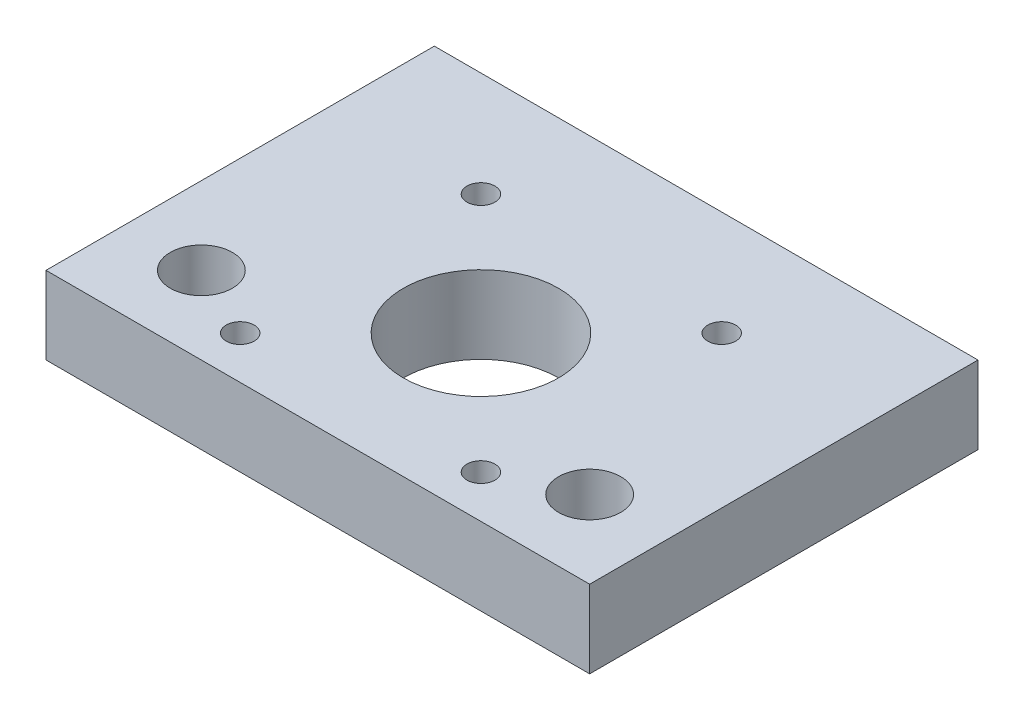
ISO-10303-21;
HEADER;
FILE_DESCRIPTION(('STEP AP214'),'2;1');
FILE_NAME('part.step','',(''),(''),'','','');
FILE_SCHEMA(('AUTOMOTIVE_DESIGN { 1 0 10303 214 1 1 1 1 }'));
ENDSEC;
DATA;
#1=APPLICATION_CONTEXT('core data for automotive mechanical design processes');
#2=APPLICATION_PROTOCOL_DEFINITION('international standard','automotive_design',2000,#1);
#3=PRODUCT_CONTEXT('',#1,'mechanical');
#4=PRODUCT('Part','Part','',(#3));
#5=PRODUCT_RELATED_PRODUCT_CATEGORY('part','',(#4));
#6=PRODUCT_DEFINITION_FORMATION('','',#4);
#7=PRODUCT_DEFINITION_CONTEXT('part definition',#1,'design');
#8=PRODUCT_DEFINITION('design','',#6,#7);
#9=PRODUCT_DEFINITION_SHAPE('','',#8);
#10=(LENGTH_UNIT() NAMED_UNIT(*) SI_UNIT(.MILLI.,.METRE.));
#11=(NAMED_UNIT(*) PLANE_ANGLE_UNIT() SI_UNIT($,.RADIAN.));
#12=(NAMED_UNIT(*) SI_UNIT($,.STERADIAN.) SOLID_ANGLE_UNIT());
#13=UNCERTAINTY_MEASURE_WITH_UNIT(LENGTH_MEASURE(1.E-05),#10,'distance_accuracy_value','');
#14=(GEOMETRIC_REPRESENTATION_CONTEXT(3) GLOBAL_UNCERTAINTY_ASSIGNED_CONTEXT((#13)) GLOBAL_UNIT_ASSIGNED_CONTEXT((#10,
#11,#12)) REPRESENTATION_CONTEXT('',''));
#15=CARTESIAN_POINT('',(0.,0.,0.));
#16=DIRECTION('',(0.,0.,1.));
#17=DIRECTION('',(1.,0.,0.));
#18=AXIS2_PLACEMENT_3D('',#15,#16,#17);
#19=CARTESIAN_POINT('',(-35.,10.,25.));
#20=DIRECTION('',(1.,0.,0.));
#21=DIRECTION('',(0.,0.,-1.));
#22=AXIS2_PLACEMENT_3D('',#19,#20,#21);
#23=PLANE('',#22);
#24=DIRECTION('',(0.,0.,1.));
#25=VECTOR('',#24,1.);
#26=CARTESIAN_POINT('',(-35.,0.,25.));
#27=LINE('',#26,#25);
#28=CARTESIAN_POINT('',(-35.,0.,-25.));
#29=VERTEX_POINT('',#28);
#30=CARTESIAN_POINT('',(-35.,0.,25.));
#31=VERTEX_POINT('',#30);
#32=EDGE_CURVE('E100',#29,#31,#27,.T.);
#33=ORIENTED_EDGE('',*,*,#32,.T.);
#34=DIRECTION('',(0.,-1.,0.));
#35=VECTOR('',#34,1.);
#36=CARTESIAN_POINT('',(-35.,10.,25.));
#37=LINE('',#36,#35);
#38=CARTESIAN_POINT('',(-35.,10.,25.));
#39=VERTEX_POINT('',#38);
#40=EDGE_CURVE('E11',#39,#31,#37,.T.);
#41=ORIENTED_EDGE('',*,*,#40,.F.);
#42=DIRECTION('',(0.,0.,1.));
#43=VECTOR('',#42,1.);
#44=CARTESIAN_POINT('',(-35.,10.,25.));
#45=LINE('',#44,#43);
#46=CARTESIAN_POINT('',(-35.,10.,-25.));
#47=VERTEX_POINT('',#46);
#48=EDGE_CURVE('E88',#47,#39,#45,.T.);
#49=ORIENTED_EDGE('',*,*,#48,.F.);
#50=DIRECTION('',(0.,-1.,0.));
#51=VECTOR('',#50,1.);
#52=CARTESIAN_POINT('',(-35.,10.,-25.));
#53=LINE('',#52,#51);
#54=EDGE_CURVE('E96',#47,#29,#53,.T.);
#55=ORIENTED_EDGE('',*,*,#54,.T.);
#56=EDGE_LOOP('',(#33,#41,#49,#55));
#57=FACE_BOUND('',#56,.T.);
#58=ADVANCED_FACE('F37',(#57),#23,.F.);
#59=CARTESIAN_POINT('',(35.,10.,25.));
#60=DIRECTION('',(0.,0.,-1.));
#61=DIRECTION('',(-1.,0.,0.));
#62=AXIS2_PLACEMENT_3D('',#59,#60,#61);
#63=PLANE('',#62);
#64=DIRECTION('',(1.,0.,0.));
#65=VECTOR('',#64,1.);
#66=CARTESIAN_POINT('',(35.,0.,25.));
#67=LINE('',#66,#65);
#68=CARTESIAN_POINT('',(35.,0.,25.));
#69=VERTEX_POINT('',#68);
#70=EDGE_CURVE('E92',#31,#69,#67,.T.);
#71=ORIENTED_EDGE('',*,*,#70,.T.);
#72=DIRECTION('',(0.,-1.,0.));
#73=VECTOR('',#72,1.);
#74=CARTESIAN_POINT('',(35.,10.,25.));
#75=LINE('',#74,#73);
#76=CARTESIAN_POINT('',(35.,10.,25.));
#77=VERTEX_POINT('',#76);
#78=EDGE_CURVE('E45',#77,#69,#75,.T.);
#79=ORIENTED_EDGE('',*,*,#78,.F.);
#80=DIRECTION('',(1.,0.,0.));
#81=VECTOR('',#80,1.);
#82=CARTESIAN_POINT('',(35.,10.,25.));
#83=LINE('',#82,#81);
#84=EDGE_CURVE('E83',#39,#77,#83,.T.);
#85=ORIENTED_EDGE('',*,*,#84,.F.);
#86=ORIENTED_EDGE('',*,*,#40,.T.);
#87=EDGE_LOOP('',(#71,#79,#85,#86));
#88=FACE_BOUND('',#87,.T.);
#89=ADVANCED_FACE('F91',(#88),#63,.F.);
#90=CARTESIAN_POINT('',(35.,10.,25.));
#91=DIRECTION('',(-1.,0.,0.));
#92=DIRECTION('',(0.,0.,1.));
#93=AXIS2_PLACEMENT_3D('',#90,#91,#92);
#94=PLANE('',#93);
#95=DIRECTION('',(0.,0.,-1.));
#96=VECTOR('',#95,1.);
#97=CARTESIAN_POINT('',(35.,0.,25.));
#98=LINE('',#97,#96);
#99=CARTESIAN_POINT('',(35.,0.,-25.));
#100=VERTEX_POINT('',#99);
#101=EDGE_CURVE('E70',#69,#100,#98,.T.);
#102=ORIENTED_EDGE('',*,*,#101,.T.);
#103=DIRECTION('',(0.,-1.,0.));
#104=VECTOR('',#103,1.);
#105=CARTESIAN_POINT('',(35.,10.,-25.));
#106=LINE('',#105,#104);
#107=CARTESIAN_POINT('',(35.,10.,-25.));
#108=VERTEX_POINT('',#107);
#109=EDGE_CURVE('E93',#108,#100,#106,.T.);
#110=ORIENTED_EDGE('',*,*,#109,.F.);
#111=DIRECTION('',(0.,0.,-1.));
#112=VECTOR('',#111,1.);
#113=CARTESIAN_POINT('',(35.,10.,25.));
#114=LINE('',#113,#112);
#115=EDGE_CURVE('E86',#77,#108,#114,.T.);
#116=ORIENTED_EDGE('',*,*,#115,.F.);
#117=ORIENTED_EDGE('',*,*,#78,.T.);
#118=EDGE_LOOP('',(#102,#110,#116,#117));
#119=FACE_BOUND('',#118,.T.);
#120=ADVANCED_FACE('F94',(#119),#94,.F.);
#121=CARTESIAN_POINT('',(35.,10.,-25.));
#122=DIRECTION('',(0.,0.,1.));
#123=DIRECTION('',(1.,0.,0.));
#124=AXIS2_PLACEMENT_3D('',#121,#122,#123);
#125=PLANE('',#124);
#126=DIRECTION('',(-1.,0.,0.));
#127=VECTOR('',#126,1.);
#128=CARTESIAN_POINT('',(35.,0.,-25.));
#129=LINE('',#128,#127);
#130=EDGE_CURVE('E76',#100,#29,#129,.T.);
#131=ORIENTED_EDGE('',*,*,#130,.T.);
#132=ORIENTED_EDGE('',*,*,#54,.F.);
#133=DIRECTION('',(-1.,0.,0.));
#134=VECTOR('',#133,1.);
#135=CARTESIAN_POINT('',(35.,10.,-25.));
#136=LINE('',#135,#134);
#137=EDGE_CURVE('E53',#108,#47,#136,.T.);
#138=ORIENTED_EDGE('',*,*,#137,.F.);
#139=ORIENTED_EDGE('',*,*,#109,.T.);
#140=EDGE_LOOP('',(#131,#132,#138,#139));
#141=FACE_BOUND('',#140,.T.);
#142=ADVANCED_FACE('F108',(#141),#125,.F.);
#143=CARTESIAN_POINT('',(0.,10.,0.));
#144=DIRECTION('',(0.,1.,0.));
#145=DIRECTION('',(0.,0.,1.));
#146=AXIS2_PLACEMENT_3D('',#143,#144,#145);
#147=PLANE('',#146);
#148=CARTESIAN_POINT('',(5.15281762734335E-13,10.,4.));
#149=DIRECTION('',(0.,-1.,0.));
#150=DIRECTION('',(0.,0.,-1.));
#151=AXIS2_PLACEMENT_3D('',#148,#149,#150);
#152=CIRCLE('',#151,10.);
#153=CARTESIAN_POINT('',(5.15281762734335E-13,10.,-6.00000000000001));
#154=VERTEX_POINT('',#153);
#155=EDGE_CURVE('E133',#154,#154,#152,.T.);
#156=ORIENTED_EDGE('',*,*,#155,.T.);
#157=EDGE_LOOP('',(#156));
#158=FACE_BOUND('',#157,.T.);
#159=CARTESIAN_POINT('',(15.5000000000005,10.,19.5));
#160=DIRECTION('',(0.,-1.,0.));
#161=DIRECTION('',(0.,0.,-1.));
#162=AXIS2_PLACEMENT_3D('',#159,#160,#161);
#163=CIRCLE('',#162,1.80000000000002);
#164=CARTESIAN_POINT('',(15.5000000000005,10.,17.7));
#165=VERTEX_POINT('',#164);
#166=EDGE_CURVE('E129',#165,#165,#163,.T.);
#167=ORIENTED_EDGE('',*,*,#166,.T.);
#168=EDGE_LOOP('',(#167));
#169=FACE_BOUND('',#168,.T.);
#170=CARTESIAN_POINT('',(15.5000000000005,10.,-11.5));
#171=DIRECTION('',(0.,-1.,0.));
#172=DIRECTION('',(0.,0.,-1.));
#173=AXIS2_PLACEMENT_3D('',#170,#171,#172);
#174=CIRCLE('',#173,1.80000000000002);
#175=CARTESIAN_POINT('',(15.5000000000005,10.,-13.3));
#176=VERTEX_POINT('',#175);
#177=EDGE_CURVE('E132',#176,#176,#174,.T.);
#178=ORIENTED_EDGE('',*,*,#177,.T.);
#179=EDGE_LOOP('',(#178));
#180=FACE_BOUND('',#179,.T.);
#181=CARTESIAN_POINT('',(-15.4999999999995,10.,-11.5));
#182=DIRECTION('',(0.,-1.,0.));
#183=DIRECTION('',(0.,0.,-1.));
#184=AXIS2_PLACEMENT_3D('',#181,#182,#183);
#185=CIRCLE('',#184,1.80000000000002);
#186=CARTESIAN_POINT('',(-15.4999999999995,10.,-13.3));
#187=VERTEX_POINT('',#186);
#188=EDGE_CURVE('E128',#187,#187,#185,.T.);
#189=ORIENTED_EDGE('',*,*,#188,.T.);
#190=EDGE_LOOP('',(#189));
#191=FACE_BOUND('',#190,.T.);
#192=CARTESIAN_POINT('',(-15.4999999999995,10.,19.5));
#193=DIRECTION('',(0.,-1.,0.));
#194=DIRECTION('',(0.,0.,-1.));
#195=AXIS2_PLACEMENT_3D('',#192,#193,#194);
#196=CIRCLE('',#195,1.80000000000002);
#197=CARTESIAN_POINT('',(-15.4999999999995,10.,17.7));
#198=VERTEX_POINT('',#197);
#199=EDGE_CURVE('E118',#198,#198,#196,.T.);
#200=ORIENTED_EDGE('',*,*,#199,.T.);
#201=EDGE_LOOP('',(#200));
#202=FACE_BOUND('',#201,.T.);
#203=CARTESIAN_POINT('',(-25.,10.,15.));
#204=DIRECTION('',(0.,1.,0.));
#205=DIRECTION('',(0.,0.,1.));
#206=AXIS2_PLACEMENT_3D('',#203,#204,#205);
#207=CIRCLE('',#206,4.);
#208=CARTESIAN_POINT('',(-25.,10.,19.));
#209=VERTEX_POINT('',#208);
#210=EDGE_CURVE('E121',#209,#209,#207,.T.);
#211=ORIENTED_EDGE('',*,*,#210,.F.);
#212=EDGE_LOOP('',(#211));
#213=FACE_BOUND('',#212,.T.);
#214=CARTESIAN_POINT('',(25.,10.,15.));
#215=DIRECTION('',(0.,1.,0.));
#216=DIRECTION('',(0.,0.,-1.));
#217=AXIS2_PLACEMENT_3D('',#214,#215,#216);
#218=CIRCLE('',#217,4.);
#219=CARTESIAN_POINT('',(25.,10.,11.));
#220=VERTEX_POINT('',#219);
#221=EDGE_CURVE('E114',#220,#220,#218,.T.);
#222=ORIENTED_EDGE('',*,*,#221,.F.);
#223=EDGE_LOOP('',(#222));
#224=FACE_BOUND('',#223,.T.);
#225=ORIENTED_EDGE('',*,*,#48,.T.);
#226=ORIENTED_EDGE('',*,*,#84,.T.);
#227=ORIENTED_EDGE('',*,*,#115,.T.);
#228=ORIENTED_EDGE('',*,*,#137,.T.);
#229=EDGE_LOOP('',(#225,#226,#227,#228));
#230=FACE_BOUND('',#229,.T.);
#231=ADVANCED_FACE('F84',(#158,#169,#180,#191,#202,#213,#224,#230),#147,.T.);
#232=CARTESIAN_POINT('',(0.,0.,0.));
#233=DIRECTION('',(0.,1.,0.));
#234=DIRECTION('',(0.,0.,1.));
#235=AXIS2_PLACEMENT_3D('',#232,#233,#234);
#236=PLANE('',#235);
#237=CARTESIAN_POINT('',(-15.4999999999995,0.,19.5));
#238=DIRECTION('',(0.,-1.,0.));
#239=DIRECTION('',(0.,0.,-1.));
#240=AXIS2_PLACEMENT_3D('',#237,#238,#239);
#241=CIRCLE('',#240,3.47);
#242=CARTESIAN_POINT('',(-15.4999999999995,0.,16.03));
#243=VERTEX_POINT('',#242);
#244=EDGE_CURVE('E164',#243,#243,#241,.T.);
#245=ORIENTED_EDGE('',*,*,#244,.F.);
#246=EDGE_LOOP('',(#245));
#247=FACE_BOUND('',#246,.T.);
#248=CARTESIAN_POINT('',(15.5000000000005,0.,19.5));
#249=DIRECTION('',(0.,-1.,0.));
#250=DIRECTION('',(0.,0.,-1.));
#251=AXIS2_PLACEMENT_3D('',#248,#249,#250);
#252=CIRCLE('',#251,3.47);
#253=CARTESIAN_POINT('',(15.5000000000005,0.,16.03));
#254=VERTEX_POINT('',#253);
#255=EDGE_CURVE('E158',#254,#254,#252,.T.);
#256=ORIENTED_EDGE('',*,*,#255,.F.);
#257=EDGE_LOOP('',(#256));
#258=FACE_BOUND('',#257,.T.);
#259=CARTESIAN_POINT('',(15.5000000000005,0.,-11.5));
#260=DIRECTION('',(0.,-1.,0.));
#261=DIRECTION('',(0.,0.,-1.));
#262=AXIS2_PLACEMENT_3D('',#259,#260,#261);
#263=CIRCLE('',#262,3.47);
#264=CARTESIAN_POINT('',(15.5000000000005,0.,-14.97));
#265=VERTEX_POINT('',#264);
#266=EDGE_CURVE('E152',#265,#265,#263,.T.);
#267=ORIENTED_EDGE('',*,*,#266,.F.);
#268=EDGE_LOOP('',(#267));
#269=FACE_BOUND('',#268,.T.);
#270=CARTESIAN_POINT('',(-15.4999999999995,0.,-11.5));
#271=DIRECTION('',(0.,-1.,0.));
#272=DIRECTION('',(0.,0.,-1.));
#273=AXIS2_PLACEMENT_3D('',#270,#271,#272);
#274=CIRCLE('',#273,3.47);
#275=CARTESIAN_POINT('',(-15.4999999999995,0.,-14.97));
#276=VERTEX_POINT('',#275);
#277=EDGE_CURVE('E146',#276,#276,#274,.T.);
#278=ORIENTED_EDGE('',*,*,#277,.F.);
#279=EDGE_LOOP('',(#278));
#280=FACE_BOUND('',#279,.T.);
#281=CARTESIAN_POINT('',(5.15281762734335E-13,0.,4.));
#282=DIRECTION('',(0.,-1.,0.));
#283=DIRECTION('',(0.,0.,-1.));
#284=AXIS2_PLACEMENT_3D('',#281,#282,#283);
#285=CIRCLE('',#284,10.);
#286=CARTESIAN_POINT('',(5.15281762734335E-13,0.,-6.00000000000001));
#287=VERTEX_POINT('',#286);
#288=EDGE_CURVE('E138',#287,#287,#285,.T.);
#289=ORIENTED_EDGE('',*,*,#288,.F.);
#290=EDGE_LOOP('',(#289));
#291=FACE_BOUND('',#290,.T.);
#292=CARTESIAN_POINT('',(-25.,0.,15.));
#293=DIRECTION('',(0.,1.,0.));
#294=DIRECTION('',(0.,0.,1.));
#295=AXIS2_PLACEMENT_3D('',#292,#293,#294);
#296=CIRCLE('',#295,4.);
#297=CARTESIAN_POINT('',(-25.,0.,19.));
#298=VERTEX_POINT('',#297);
#299=EDGE_CURVE('E103',#298,#298,#296,.T.);
#300=ORIENTED_EDGE('',*,*,#299,.T.);
#301=EDGE_LOOP('',(#300));
#302=FACE_BOUND('',#301,.T.);
#303=CARTESIAN_POINT('',(25.,0.,15.));
#304=DIRECTION('',(0.,1.,0.));
#305=DIRECTION('',(0.,0.,-1.));
#306=AXIS2_PLACEMENT_3D('',#303,#304,#305);
#307=CIRCLE('',#306,4.);
#308=CARTESIAN_POINT('',(25.,0.,11.));
#309=VERTEX_POINT('',#308);
#310=EDGE_CURVE('E117',#309,#309,#307,.T.);
#311=ORIENTED_EDGE('',*,*,#310,.T.);
#312=EDGE_LOOP('',(#311));
#313=FACE_BOUND('',#312,.T.);
#314=ORIENTED_EDGE('',*,*,#32,.F.);
#315=ORIENTED_EDGE('',*,*,#130,.F.);
#316=ORIENTED_EDGE('',*,*,#101,.F.);
#317=ORIENTED_EDGE('',*,*,#70,.F.);
#318=EDGE_LOOP('',(#314,#315,#316,#317));
#319=FACE_BOUND('',#318,.T.);
#320=ADVANCED_FACE('F111',(#247,#258,#269,#280,#291,#302,#313,#319),#236,.F.);
#321=CARTESIAN_POINT('',(25.,0.,15.));
#322=DIRECTION('',(0.,1.,0.));
#323=DIRECTION('',(0.,0.,1.));
#324=AXIS2_PLACEMENT_3D('',#321,#322,#323);
#325=CYLINDRICAL_SURFACE('',#324,4.);
#326=ORIENTED_EDGE('',*,*,#310,.F.);
#327=EDGE_LOOP('',(#326));
#328=FACE_BOUND('',#327,.T.);
#329=ORIENTED_EDGE('',*,*,#221,.T.);
#330=EDGE_LOOP('',(#329));
#331=FACE_BOUND('',#330,.T.);
#332=ADVANCED_FACE('F173',(#328,#331),#325,.F.);
#333=CARTESIAN_POINT('',(-25.,0.,15.));
#334=DIRECTION('',(0.,1.,0.));
#335=DIRECTION('',(0.,0.,1.));
#336=AXIS2_PLACEMENT_3D('',#333,#334,#335);
#337=CYLINDRICAL_SURFACE('',#336,4.);
#338=ORIENTED_EDGE('',*,*,#299,.F.);
#339=EDGE_LOOP('',(#338));
#340=FACE_BOUND('',#339,.T.);
#341=ORIENTED_EDGE('',*,*,#210,.T.);
#342=EDGE_LOOP('',(#341));
#343=FACE_BOUND('',#342,.T.);
#344=ADVANCED_FACE('F189',(#340,#343),#337,.F.);
#345=CARTESIAN_POINT('',(-15.4999999999995,10.,19.5));
#346=DIRECTION('',(0.,-1.,0.));
#347=DIRECTION('',(0.,0.,-1.));
#348=AXIS2_PLACEMENT_3D('',#345,#346,#347);
#349=CYLINDRICAL_SURFACE('',#348,1.80000000000002);
#350=CARTESIAN_POINT('',(-15.4999999999995,1.66999999999999,19.5));
#351=DIRECTION('',(0.,-1.,0.));
#352=DIRECTION('',(0.,0.,-1.));
#353=AXIS2_PLACEMENT_3D('',#350,#351,#352);
#354=CIRCLE('',#353,1.80000000000002);
#355=CARTESIAN_POINT('',(-15.4999999999995,1.66999999999999,17.7));
#356=VERTEX_POINT('',#355);
#357=EDGE_CURVE('E161',#356,#356,#354,.T.);
#358=ORIENTED_EDGE('',*,*,#357,.T.);
#359=EDGE_LOOP('',(#358));
#360=FACE_BOUND('',#359,.T.);
#361=ORIENTED_EDGE('',*,*,#199,.F.);
#362=EDGE_LOOP('',(#361));
#363=FACE_BOUND('',#362,.T.);
#364=ADVANCED_FACE('F231',(#360,#363),#349,.F.);
#365=CARTESIAN_POINT('',(-15.4999999999995,10.,-11.5));
#366=DIRECTION('',(0.,-1.,0.));
#367=DIRECTION('',(0.,0.,-1.));
#368=AXIS2_PLACEMENT_3D('',#365,#366,#367);
#369=CYLINDRICAL_SURFACE('',#368,1.80000000000002);
#370=CARTESIAN_POINT('',(-15.4999999999995,1.66999999999999,-11.5));
#371=DIRECTION('',(0.,-1.,0.));
#372=DIRECTION('',(0.,0.,-1.));
#373=AXIS2_PLACEMENT_3D('',#370,#371,#372);
#374=CIRCLE('',#373,1.80000000000002);
#375=CARTESIAN_POINT('',(-15.4999999999995,1.66999999999999,-13.3));
#376=VERTEX_POINT('',#375);
#377=EDGE_CURVE('E141',#376,#376,#374,.T.);
#378=ORIENTED_EDGE('',*,*,#377,.T.);
#379=EDGE_LOOP('',(#378));
#380=FACE_BOUND('',#379,.T.);
#381=ORIENTED_EDGE('',*,*,#188,.F.);
#382=EDGE_LOOP('',(#381));
#383=FACE_BOUND('',#382,.T.);
#384=ADVANCED_FACE('F266',(#380,#383),#369,.F.);
#385=CARTESIAN_POINT('',(15.5000000000005,10.,-11.5));
#386=DIRECTION('',(0.,-1.,0.));
#387=DIRECTION('',(0.,0.,-1.));
#388=AXIS2_PLACEMENT_3D('',#385,#386,#387);
#389=CYLINDRICAL_SURFACE('',#388,1.80000000000002);
#390=CARTESIAN_POINT('',(15.5000000000005,1.66999999999998,-11.5));
#391=DIRECTION('',(0.,-1.,0.));
#392=DIRECTION('',(0.,0.,-1.));
#393=AXIS2_PLACEMENT_3D('',#390,#391,#392);
#394=CIRCLE('',#393,1.80000000000002);
#395=CARTESIAN_POINT('',(15.5000000000005,1.66999999999998,-13.3));
#396=VERTEX_POINT('',#395);
#397=EDGE_CURVE('E149',#396,#396,#394,.T.);
#398=ORIENTED_EDGE('',*,*,#397,.T.);
#399=EDGE_LOOP('',(#398));
#400=FACE_BOUND('',#399,.T.);
#401=ORIENTED_EDGE('',*,*,#177,.F.);
#402=EDGE_LOOP('',(#401));
#403=FACE_BOUND('',#402,.T.);
#404=ADVANCED_FACE('F276',(#400,#403),#389,.F.);
#405=CARTESIAN_POINT('',(15.5000000000005,10.,19.5));
#406=DIRECTION('',(0.,-1.,0.));
#407=DIRECTION('',(0.,0.,-1.));
#408=AXIS2_PLACEMENT_3D('',#405,#406,#407);
#409=CYLINDRICAL_SURFACE('',#408,1.80000000000002);
#410=CARTESIAN_POINT('',(15.5000000000005,1.66999999999998,19.5));
#411=DIRECTION('',(0.,-1.,0.));
#412=DIRECTION('',(0.,0.,-1.));
#413=AXIS2_PLACEMENT_3D('',#410,#411,#412);
#414=CIRCLE('',#413,1.80000000000002);
#415=CARTESIAN_POINT('',(15.5000000000005,1.66999999999998,17.7));
#416=VERTEX_POINT('',#415);
#417=EDGE_CURVE('E155',#416,#416,#414,.T.);
#418=ORIENTED_EDGE('',*,*,#417,.T.);
#419=EDGE_LOOP('',(#418));
#420=FACE_BOUND('',#419,.T.);
#421=ORIENTED_EDGE('',*,*,#166,.F.);
#422=EDGE_LOOP('',(#421));
#423=FACE_BOUND('',#422,.T.);
#424=ADVANCED_FACE('F249',(#420,#423),#409,.F.);
#425=CARTESIAN_POINT('',(5.15281762734335E-13,10.,4.));
#426=DIRECTION('',(0.,-1.,0.));
#427=DIRECTION('',(0.,0.,-1.));
#428=AXIS2_PLACEMENT_3D('',#425,#426,#427);
#429=CYLINDRICAL_SURFACE('',#428,10.);
#430=ORIENTED_EDGE('',*,*,#155,.F.);
#431=EDGE_LOOP('',(#430));
#432=FACE_BOUND('',#431,.T.);
#433=ORIENTED_EDGE('',*,*,#288,.T.);
#434=EDGE_LOOP('',(#433));
#435=FACE_BOUND('',#434,.T.);
#436=ADVANCED_FACE('F243',(#432,#435),#429,.F.);
#437=CARTESIAN_POINT('',(-15.4999999999995,0.,-11.5));
#438=DIRECTION('',(0.,-1.,0.));
#439=DIRECTION('',(0.,0.,-1.));
#440=AXIS2_PLACEMENT_3D('',#437,#438,#439);
#441=CONICAL_SURFACE('',#440,3.47,0.785398163397448);
#442=ORIENTED_EDGE('',*,*,#277,.T.);
#443=EDGE_LOOP('',(#442));
#444=FACE_BOUND('',#443,.T.);
#445=ORIENTED_EDGE('',*,*,#377,.F.);
#446=EDGE_LOOP('',(#445));
#447=FACE_BOUND('',#446,.T.);
#448=ADVANCED_FACE('F248',(#444,#447),#441,.F.);
#449=CARTESIAN_POINT('',(15.5000000000005,0.,-11.5));
#450=DIRECTION('',(0.,-1.,0.));
#451=DIRECTION('',(0.,0.,-1.));
#452=AXIS2_PLACEMENT_3D('',#449,#450,#451);
#453=CONICAL_SURFACE('',#452,3.47,0.785398163397448);
#454=ORIENTED_EDGE('',*,*,#266,.T.);
#455=EDGE_LOOP('',(#454));
#456=FACE_BOUND('',#455,.T.);
#457=ORIENTED_EDGE('',*,*,#397,.F.);
#458=EDGE_LOOP('',(#457));
#459=FACE_BOUND('',#458,.T.);
#460=ADVANCED_FACE('F300',(#456,#459),#453,.F.);
#461=CARTESIAN_POINT('',(15.5000000000005,0.,19.5));
#462=DIRECTION('',(0.,-1.,0.));
#463=DIRECTION('',(0.,0.,-1.));
#464=AXIS2_PLACEMENT_3D('',#461,#462,#463);
#465=CONICAL_SURFACE('',#464,3.47,0.785398163397448);
#466=ORIENTED_EDGE('',*,*,#255,.T.);
#467=EDGE_LOOP('',(#466));
#468=FACE_BOUND('',#467,.T.);
#469=ORIENTED_EDGE('',*,*,#417,.F.);
#470=EDGE_LOOP('',(#469));
#471=FACE_BOUND('',#470,.T.);
#472=ADVANCED_FACE('F310',(#468,#471),#465,.F.);
#473=CARTESIAN_POINT('',(-15.4999999999995,0.,19.5));
#474=DIRECTION('',(0.,-1.,0.));
#475=DIRECTION('',(0.,0.,-1.));
#476=AXIS2_PLACEMENT_3D('',#473,#474,#475);
#477=CONICAL_SURFACE('',#476,3.47,0.785398163397448);
#478=ORIENTED_EDGE('',*,*,#244,.T.);
#479=EDGE_LOOP('',(#478));
#480=FACE_BOUND('',#479,.T.);
#481=ORIENTED_EDGE('',*,*,#357,.F.);
#482=EDGE_LOOP('',(#481));
#483=FACE_BOUND('',#482,.T.);
#484=ADVANCED_FACE('F168',(#480,#483),#477,.F.);
#485=CLOSED_SHELL('',(#58,#89,#120,#142,#231,#320,#332,#344,#364,#384,#404,#424,#436,#448,#460,
#472,#484));
#486=MANIFOLD_SOLID_BREP('B2',#485);
#487=ADVANCED_BREP_SHAPE_REPRESENTATION('',(#18,#486),#14);
#488=SHAPE_DEFINITION_REPRESENTATION(#9,#487);
ENDSEC;
END-ISO-10303-21;
